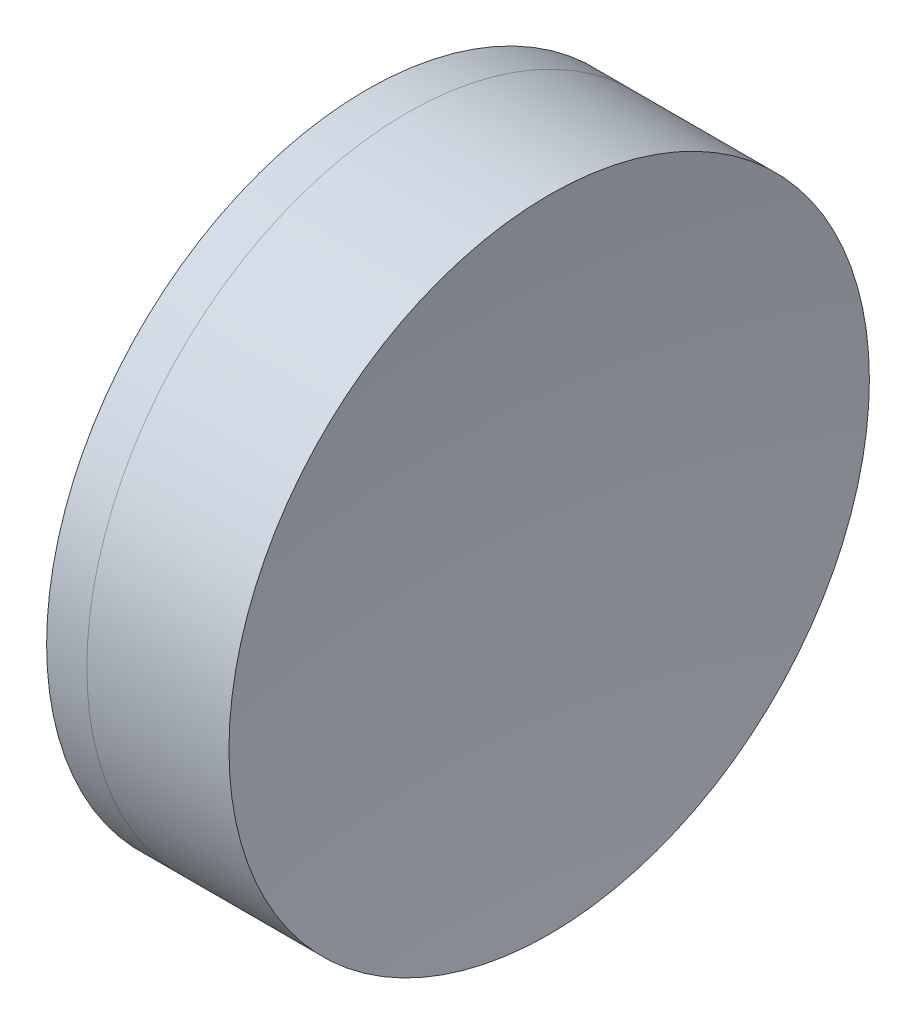
ISO-10303-21;
HEADER;
FILE_DESCRIPTION(('STEP AP214'),'2;1');
FILE_NAME('part.step','',(''),(''),'','','');
FILE_SCHEMA(('AUTOMOTIVE_DESIGN { 1 0 10303 214 1 1 1 1 }'));
ENDSEC;
DATA;
#1=APPLICATION_CONTEXT('core data for automotive mechanical design processes');
#2=APPLICATION_PROTOCOL_DEFINITION('international standard','automotive_design',2000,#1);
#3=PRODUCT_CONTEXT('',#1,'mechanical');
#4=PRODUCT('Part','Part','',(#3));
#5=PRODUCT_RELATED_PRODUCT_CATEGORY('part','',(#4));
#6=PRODUCT_DEFINITION_FORMATION('','',#4);
#7=PRODUCT_DEFINITION_CONTEXT('part definition',#1,'design');
#8=PRODUCT_DEFINITION('design','',#6,#7);
#9=PRODUCT_DEFINITION_SHAPE('','',#8);
#10=(LENGTH_UNIT() NAMED_UNIT(*) SI_UNIT(.MILLI.,.METRE.));
#11=(NAMED_UNIT(*) PLANE_ANGLE_UNIT() SI_UNIT($,.RADIAN.));
#12=(NAMED_UNIT(*) SI_UNIT($,.STERADIAN.) SOLID_ANGLE_UNIT());
#13=UNCERTAINTY_MEASURE_WITH_UNIT(LENGTH_MEASURE(1.E-05),#10,'distance_accuracy_value','');
#14=(GEOMETRIC_REPRESENTATION_CONTEXT(3) GLOBAL_UNCERTAINTY_ASSIGNED_CONTEXT((#13)) GLOBAL_UNIT_ASSIGNED_CONTEXT((#10,
#11,#12)) REPRESENTATION_CONTEXT('',''));
#15=CARTESIAN_POINT('',(0.,0.,0.));
#16=DIRECTION('',(0.,0.,1.));
#17=DIRECTION('',(1.,0.,0.));
#18=AXIS2_PLACEMENT_3D('',#15,#16,#17);
#19=CARTESIAN_POINT('',(68.0629667487321,0.,0.));
#20=DIRECTION('',(-1.,0.,0.));
#21=DIRECTION('',(0.,0.,-1.));
#22=AXIS2_PLACEMENT_3D('',#19,#20,#21);
#23=SPHERICAL_SURFACE('',#22,33.91);
#24=CARTESIAN_POINT('',(98.4749397199156,0.,0.));
#25=DIRECTION('',(-1.,0.,0.));
#26=DIRECTION('',(0.,0.,1.));
#27=AXIS2_PLACEMENT_3D('',#24,#25,#26);
#28=CIRCLE('',#27,15.);
#29=CARTESIAN_POINT('',(98.4749397199156,0.,15.));
#30=VERTEX_POINT('',#29);
#31=EDGE_CURVE('E51',#30,#30,#28,.T.);
#32=ORIENTED_EDGE('',*,*,#31,.T.);
#33=EDGE_LOOP('',(#32));
#34=FACE_BOUND('',#33,.T.);
#35=ADVANCED_FACE('F45',(#34),#23,.F.);
#36=CARTESIAN_POINT('',(201.692966748732,0.,0.));
#37=DIRECTION('',(-1.,0.,0.));
#38=DIRECTION('',(0.,0.,-1.));
#39=AXIS2_PLACEMENT_3D('',#36,#37,#38);
#40=SPHERICAL_SURFACE('',#39,97.72);
#41=CARTESIAN_POINT('',(105.131077786264,0.,0.));
#42=DIRECTION('',(-1.,0.,0.));
#43=DIRECTION('',(0.,0.,1.));
#44=AXIS2_PLACEMENT_3D('',#41,#42,#43);
#45=CIRCLE('',#44,15.);
#46=CARTESIAN_POINT('',(105.131077786264,0.,15.));
#47=VERTEX_POINT('',#46);
#48=EDGE_CURVE('E11',#47,#47,#45,.T.);
#49=ORIENTED_EDGE('',*,*,#48,.F.);
#50=EDGE_LOOP('',(#49));
#51=FACE_BOUND('',#50,.T.);
#52=ADVANCED_FACE('F60',(#51),#40,.F.);
#53=CARTESIAN_POINT('',(-0.551919992657797,0.,0.));
#54=DIRECTION('',(-1.,0.,0.));
#55=DIRECTION('',(0.,0.,1.));
#56=AXIS2_PLACEMENT_3D('',#53,#54,#55);
#57=CYLINDRICAL_SURFACE('',#56,15.);
#58=ORIENTED_EDGE('',*,*,#48,.T.);
#59=EDGE_LOOP('',(#58));
#60=FACE_BOUND('',#59,.T.);
#61=ORIENTED_EDGE('',*,*,#31,.F.);
#62=EDGE_LOOP('',(#61));
#63=FACE_BOUND('',#62,.T.);
#64=ADVANCED_FACE('F58',(#60,#63),#57,.T.);
#65=CLOSED_SHELL('',(#35,#52,#64));
#66=MANIFOLD_SOLID_BREP('B2',#65);
#67=CARTESIAN_POINT('',(121.852966748732,0.,0.));
#68=DIRECTION('',(-1.,0.,0.));
#69=DIRECTION('',(0.,0.,1.));
#70=AXIS2_PLACEMENT_3D('',#67,#68,#69);
#71=SPHERICAL_SURFACE('',#70,29.38);
#72=CARTESIAN_POINT('',(96.5906548988637,0.,0.));
#73=DIRECTION('',(-1.,0.,0.));
#74=DIRECTION('',(0.,0.,1.));
#75=AXIS2_PLACEMENT_3D('',#72,#73,#74);
#76=CIRCLE('',#75,15.);
#77=CARTESIAN_POINT('',(96.5906548988637,0.,15.));
#78=VERTEX_POINT('',#77);
#79=EDGE_CURVE('E44',#78,#78,#76,.T.);
#80=ORIENTED_EDGE('',*,*,#79,.T.);
#81=EDGE_LOOP('',(#80));
#82=FACE_BOUND('',#81,.T.);
#83=ADVANCED_FACE('F86',(#82),#71,.T.);
#84=CARTESIAN_POINT('',(-0.816062176165804,0.,0.));
#85=DIRECTION('',(-1.,0.,0.));
#86=DIRECTION('',(0.,0.,1.));
#87=AXIS2_PLACEMENT_3D('',#84,#85,#86);
#88=CYLINDRICAL_SURFACE('',#87,15.);
#89=CARTESIAN_POINT('',(98.4749397199156,0.,0.));
#90=DIRECTION('',(-1.,0.,0.));
#91=DIRECTION('',(0.,0.,1.));
#92=AXIS2_PLACEMENT_3D('',#89,#90,#91);
#93=CIRCLE('',#92,15.);
#94=CARTESIAN_POINT('',(98.4749397199156,0.,15.));
#95=VERTEX_POINT('',#94);
#96=EDGE_CURVE('E92',#95,#95,#93,.T.);
#97=ORIENTED_EDGE('',*,*,#96,.T.);
#98=EDGE_LOOP('',(#97));
#99=FACE_BOUND('',#98,.T.);
#100=ORIENTED_EDGE('',*,*,#79,.F.);
#101=EDGE_LOOP('',(#100));
#102=FACE_BOUND('',#101,.T.);
#103=ADVANCED_FACE('F98',(#99,#102),#88,.T.);
#104=CARTESIAN_POINT('',(68.0629667487321,0.,0.));
#105=DIRECTION('',(-1.,0.,0.));
#106=DIRECTION('',(0.,0.,1.));
#107=AXIS2_PLACEMENT_3D('',#104,#105,#106);
#108=SPHERICAL_SURFACE('',#107,33.91);
#109=ORIENTED_EDGE('',*,*,#96,.F.);
#110=EDGE_LOOP('',(#109));
#111=FACE_BOUND('',#110,.T.);
#112=ADVANCED_FACE('F101',(#111),#108,.T.);
#113=CLOSED_SHELL('',(#83,#103,#112));
#114=MANIFOLD_SOLID_BREP('B6',#113);
#115=ADVANCED_BREP_SHAPE_REPRESENTATION('',(#18,#66,#114),#14);
#116=SHAPE_DEFINITION_REPRESENTATION(#9,#115);
ENDSEC;
END-ISO-10303-21;
